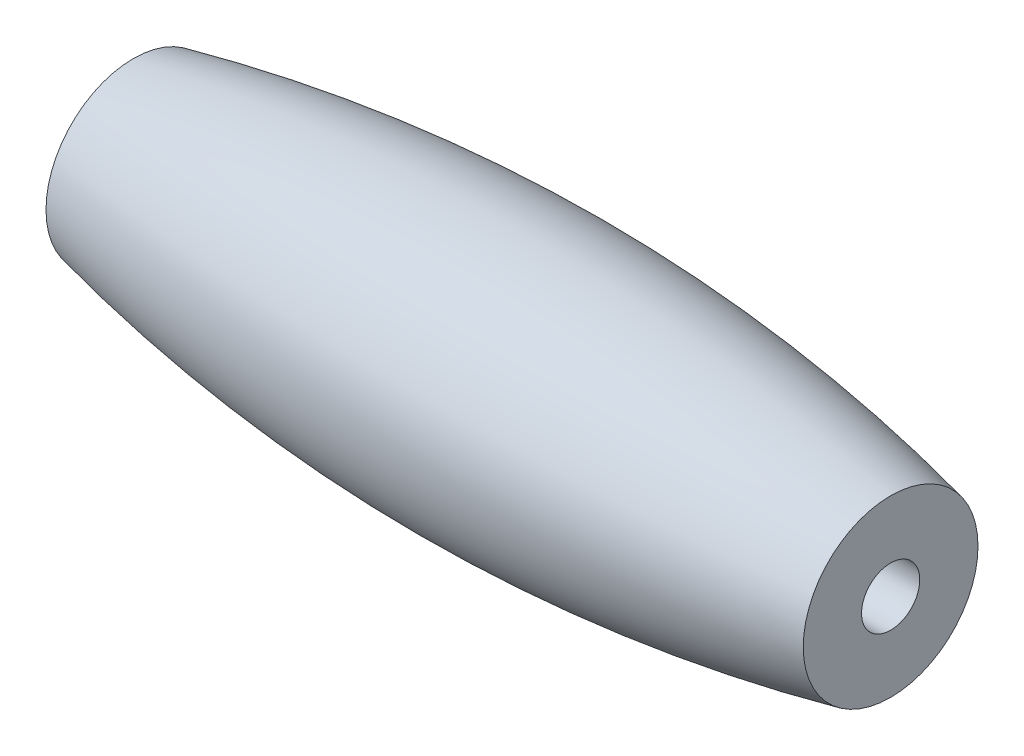
ISO-10303-21;
HEADER;
FILE_DESCRIPTION(('STEP AP214'),'2;1');
FILE_NAME('part.step','',(''),(''),'','','');
FILE_SCHEMA(('AUTOMOTIVE_DESIGN { 1 0 10303 214 1 1 1 1 }'));
ENDSEC;
DATA;
#1=APPLICATION_CONTEXT('core data for automotive mechanical design processes');
#2=APPLICATION_PROTOCOL_DEFINITION('international standard','automotive_design',2000,#1);
#3=PRODUCT_CONTEXT('',#1,'mechanical');
#4=PRODUCT('Part','Part','',(#3));
#5=PRODUCT_RELATED_PRODUCT_CATEGORY('part','',(#4));
#6=PRODUCT_DEFINITION_FORMATION('','',#4);
#7=PRODUCT_DEFINITION_CONTEXT('part definition',#1,'design');
#8=PRODUCT_DEFINITION('design','',#6,#7);
#9=PRODUCT_DEFINITION_SHAPE('','',#8);
#10=(LENGTH_UNIT() NAMED_UNIT(*) SI_UNIT(.MILLI.,.METRE.));
#11=(NAMED_UNIT(*) PLANE_ANGLE_UNIT() SI_UNIT($,.RADIAN.));
#12=(NAMED_UNIT(*) SI_UNIT($,.STERADIAN.) SOLID_ANGLE_UNIT());
#13=UNCERTAINTY_MEASURE_WITH_UNIT(LENGTH_MEASURE(1.E-05),#10,'distance_accuracy_value','');
#14=(GEOMETRIC_REPRESENTATION_CONTEXT(3) GLOBAL_UNCERTAINTY_ASSIGNED_CONTEXT((#13)) GLOBAL_UNIT_ASSIGNED_CONTEXT((#10,
#11,#12)) REPRESENTATION_CONTEXT('',''));
#15=CARTESIAN_POINT('',(0.,0.,0.));
#16=DIRECTION('',(0.,0.,1.));
#17=DIRECTION('',(1.,0.,0.));
#18=AXIS2_PLACEMENT_3D('',#15,#16,#17);
#19=CARTESIAN_POINT('',(-6.5,0.,0.));
#20=DIRECTION('',(1.,0.,0.));
#21=DIRECTION('',(0.,0.,-1.));
#22=AXIS2_PLACEMENT_3D('',#19,#20,#21);
#23=PLANE('',#22);
#24=CARTESIAN_POINT('',(-6.5,0.,0.));
#25=DIRECTION('',(1.,0.,0.));
#26=DIRECTION('',(0.,0.,-1.));
#27=AXIS2_PLACEMENT_3D('',#24,#25,#26);
#28=CIRCLE('',#27,0.5);
#29=CARTESIAN_POINT('',(-6.5,0.,-0.5));
#30=VERTEX_POINT('',#29);
#31=EDGE_CURVE('E54',#30,#30,#28,.T.);
#32=ORIENTED_EDGE('',*,*,#31,.T.);
#33=EDGE_LOOP('',(#32));
#34=FACE_BOUND('',#33,.T.);
#35=CARTESIAN_POINT('',(-6.5,0.,0.));
#36=DIRECTION('',(-1.,0.,0.));
#37=DIRECTION('',(0.,0.,1.));
#38=AXIS2_PLACEMENT_3D('',#35,#36,#37);
#39=CIRCLE('',#38,1.5);
#40=CARTESIAN_POINT('',(-6.5,0.,1.5));
#41=VERTEX_POINT('',#40);
#42=EDGE_CURVE('E10',#41,#41,#39,.T.);
#43=ORIENTED_EDGE('',*,*,#42,.T.);
#44=EDGE_LOOP('',(#43));
#45=FACE_BOUND('',#44,.T.);
#46=ADVANCED_FACE('F42',(#34,#45),#23,.F.);
#47=CARTESIAN_POINT('',(0.,0.,0.));
#48=DIRECTION('',(-1.,0.,0.));
#49=DIRECTION('',(0.,0.,1.));
#50=AXIS2_PLACEMENT_3D('',#47,#48,#49);
#51=DEGENERATE_TOROIDAL_SURFACE('',#50,27.7873692912149,30.,.F.);
#52=ORIENTED_EDGE('',*,*,#42,.F.);
#53=EDGE_LOOP('',(#52));
#54=FACE_BOUND('',#53,.T.);
#55=CARTESIAN_POINT('',(6.5,0.,0.));
#56=DIRECTION('',(-1.,0.,0.));
#57=DIRECTION('',(0.,0.,1.));
#58=AXIS2_PLACEMENT_3D('',#55,#56,#57);
#59=CIRCLE('',#58,1.5);
#60=CARTESIAN_POINT('',(6.5,0.,1.5));
#61=VERTEX_POINT('',#60);
#62=EDGE_CURVE('E49',#61,#61,#59,.T.);
#63=ORIENTED_EDGE('',*,*,#62,.T.);
#64=EDGE_LOOP('',(#63));
#65=FACE_BOUND('',#64,.T.);
#66=ADVANCED_FACE('F71',(#54,#65),#51,.F.);
#67=CARTESIAN_POINT('',(6.5,1.5,0.));
#68=DIRECTION('',(-1.,0.,0.));
#69=DIRECTION('',(0.,0.,1.));
#70=AXIS2_PLACEMENT_3D('',#67,#68,#69);
#71=PLANE('',#70);
#72=CARTESIAN_POINT('',(6.5,0.,0.));
#73=DIRECTION('',(1.,0.,0.));
#74=DIRECTION('',(0.,0.,-1.));
#75=AXIS2_PLACEMENT_3D('',#72,#73,#74);
#76=CIRCLE('',#75,0.5);
#77=CARTESIAN_POINT('',(6.5,0.,-0.5));
#78=VERTEX_POINT('',#77);
#79=EDGE_CURVE('E59',#78,#78,#76,.T.);
#80=ORIENTED_EDGE('',*,*,#79,.F.);
#81=EDGE_LOOP('',(#80));
#82=FACE_BOUND('',#81,.T.);
#83=ORIENTED_EDGE('',*,*,#62,.F.);
#84=EDGE_LOOP('',(#83));
#85=FACE_BOUND('',#84,.T.);
#86=ADVANCED_FACE('F68',(#82,#85),#71,.F.);
#87=CARTESIAN_POINT('',(-6.5,0.,0.));
#88=DIRECTION('',(1.,0.,0.));
#89=DIRECTION('',(0.,0.,-1.));
#90=AXIS2_PLACEMENT_3D('',#87,#88,#89);
#91=CYLINDRICAL_SURFACE('',#90,0.5);
#92=ORIENTED_EDGE('',*,*,#31,.F.);
#93=EDGE_LOOP('',(#92));
#94=FACE_BOUND('',#93,.T.);
#95=ORIENTED_EDGE('',*,*,#79,.T.);
#96=EDGE_LOOP('',(#95));
#97=FACE_BOUND('',#96,.T.);
#98=ADVANCED_FACE('F66',(#94,#97),#91,.F.);
#99=CLOSED_SHELL('',(#46,#66,#86,#98));
#100=MANIFOLD_SOLID_BREP('B2',#99);
#101=ADVANCED_BREP_SHAPE_REPRESENTATION('',(#18,#100),#14);
#102=SHAPE_DEFINITION_REPRESENTATION(#9,#101);
ENDSEC;
END-ISO-10303-21;
